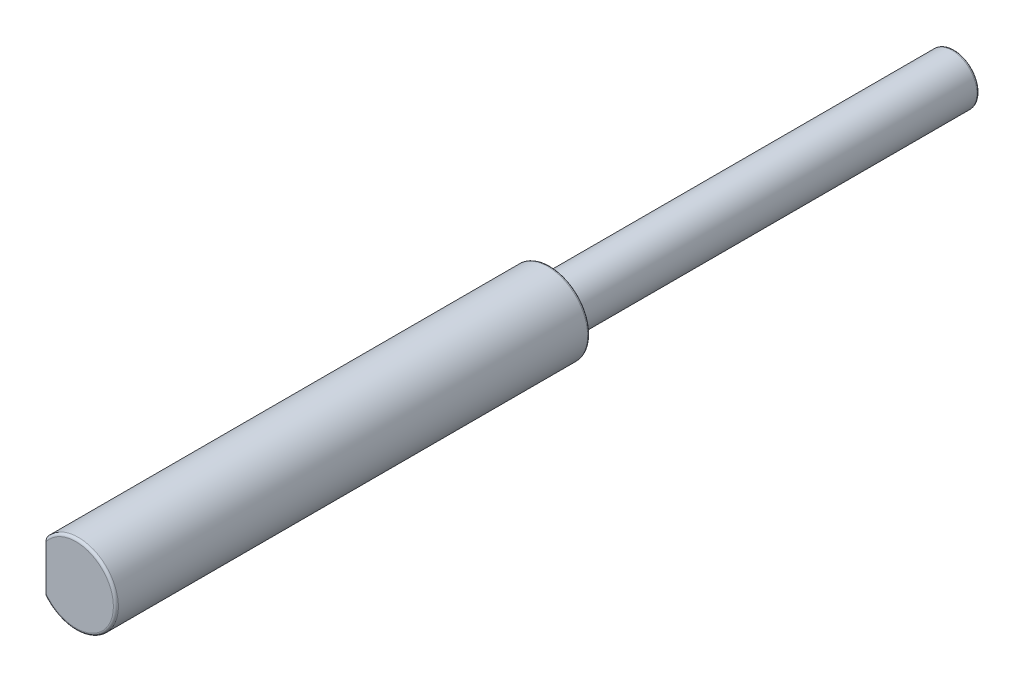
ISO-10303-21;
HEADER;
FILE_DESCRIPTION(('STEP AP214'),'2;1');
FILE_NAME('part.step','',(''),(''),'','','');
FILE_SCHEMA(('AUTOMOTIVE_DESIGN { 1 0 10303 214 1 1 1 1 }'));
ENDSEC;
DATA;
#1=APPLICATION_CONTEXT('core data for automotive mechanical design processes');
#2=APPLICATION_PROTOCOL_DEFINITION('international standard','automotive_design',2000,#1);
#3=PRODUCT_CONTEXT('',#1,'mechanical');
#4=PRODUCT('Part','Part','',(#3));
#5=PRODUCT_RELATED_PRODUCT_CATEGORY('part','',(#4));
#6=PRODUCT_DEFINITION_FORMATION('','',#4);
#7=PRODUCT_DEFINITION_CONTEXT('part definition',#1,'design');
#8=PRODUCT_DEFINITION('design','',#6,#7);
#9=PRODUCT_DEFINITION_SHAPE('','',#8);
#10=(LENGTH_UNIT() NAMED_UNIT(*) SI_UNIT(.MILLI.,.METRE.));
#11=(NAMED_UNIT(*) PLANE_ANGLE_UNIT() SI_UNIT($,.RADIAN.));
#12=(NAMED_UNIT(*) SI_UNIT($,.STERADIAN.) SOLID_ANGLE_UNIT());
#13=UNCERTAINTY_MEASURE_WITH_UNIT(LENGTH_MEASURE(1.E-05),#10,'distance_accuracy_value','');
#14=(GEOMETRIC_REPRESENTATION_CONTEXT(3) GLOBAL_UNCERTAINTY_ASSIGNED_CONTEXT((#13)) GLOBAL_UNIT_ASSIGNED_CONTEXT((#10,
#11,#12)) REPRESENTATION_CONTEXT('',''));
#15=CARTESIAN_POINT('',(0.,0.,0.));
#16=DIRECTION('',(0.,0.,1.));
#17=DIRECTION('',(1.,0.,0.));
#18=AXIS2_PLACEMENT_3D('',#15,#16,#17);
#19=CARTESIAN_POINT('',(0.,0.,88.));
#20=DIRECTION('',(0.,0.,-1.));
#21=DIRECTION('',(-1.,0.,0.));
#22=AXIS2_PLACEMENT_3D('',#19,#20,#21);
#23=CYLINDRICAL_SURFACE('',#22,4.);
#24=CARTESIAN_POINT('',(0.,0.,40.75));
#25=DIRECTION('',(0.,0.,1.));
#26=DIRECTION('',(1.,0.,0.));
#27=AXIS2_PLACEMENT_3D('',#24,#25,#26);
#28=CIRCLE('',#27,4.);
#29=CARTESIAN_POINT('',(4.,0.,40.75));
#30=VERTEX_POINT('',#29);
#31=EDGE_CURVE('E67',#30,#30,#28,.T.);
#32=ORIENTED_EDGE('',*,*,#31,.T.);
#33=EDGE_LOOP('',(#32));
#34=FACE_BOUND('',#33,.T.);
#35=DIRECTION('',(0.,0.,-1.));
#36=VECTOR('',#35,1.);
#37=CARTESIAN_POINT('',(-3.,2.6457513110646,88.));
#38=LINE('',#37,#36);
#39=CARTESIAN_POINT('',(-3.,2.64575131106459,87.75));
#40=VERTEX_POINT('',#39);
#41=CARTESIAN_POINT('',(-3.,2.64575131106459,74.));
#42=VERTEX_POINT('',#41);
#43=EDGE_CURVE('E63',#40,#42,#38,.T.);
#44=ORIENTED_EDGE('',*,*,#43,.F.);
#45=CARTESIAN_POINT('',(0.,0.,87.75));
#46=DIRECTION('',(0.,0.,1.));
#47=DIRECTION('',(1.,0.,0.));
#48=AXIS2_PLACEMENT_3D('',#45,#46,#47);
#49=CIRCLE('',#48,4.);
#50=CARTESIAN_POINT('',(-3.,-2.6457513110822,87.7500000000068));
#51=VERTEX_POINT('',#50);
#52=EDGE_CURVE('E71',#40,#51,#49,.F.);
#53=ORIENTED_EDGE('',*,*,#52,.T.);
#54=DIRECTION('',(0.,0.,-1.));
#55=VECTOR('',#54,1.);
#56=CARTESIAN_POINT('',(-3.,-2.6457513110646,88.));
#57=LINE('',#56,#55);
#58=CARTESIAN_POINT('',(-3.,-2.64575131106459,74.));
#59=VERTEX_POINT('',#58);
#60=EDGE_CURVE('E43',#59,#51,#57,.F.);
#61=ORIENTED_EDGE('',*,*,#60,.F.);
#62=CARTESIAN_POINT('',(-3.,2.64575131106459,74.));
#63=CARTESIAN_POINT('',(-2.99999721865765,2.64575264763035,73.9791771017932));
#64=CARTESIAN_POINT('',(-3.00065104414322,2.64501325874664,73.958366710262));
#65=CARTESIAN_POINT('',(-3.00323971390563,2.64207438655803,73.9169420901106));
#66=CARTESIAN_POINT('',(-3.00517377049945,2.6398758010454,73.8963277487733));
#67=CARTESIAN_POINT('',(-3.01280599735035,2.63117123632498,73.8353426194659));
#68=CARTESIAN_POINT('',(-3.02033543065855,2.62255555932588,73.7954723155136));
#69=CARTESIAN_POINT('',(-3.03963373462192,2.6001615243326,73.7184409175593));
#70=CARTESIAN_POINT('',(-3.05139419352771,2.5863934077931,73.6812746227141));
#71=CARTESIAN_POINT('',(-3.0783011290155,2.55431036258328,73.6102337240712));
#72=CARTESIAN_POINT('',(-3.09345363670256,2.53598732872243,73.5763651394893));
#73=CARTESIAN_POINT('',(-3.13187000105026,2.48849477917767,73.5013130031303));
#74=CARTESIAN_POINT('',(-3.156129633108,2.45776344734113,73.4616309088326));
#75=CARTESIAN_POINT('',(-3.20710305301898,2.39087242504346,73.3890245884467));
#76=CARTESIAN_POINT('',(-3.23382106534995,2.35470332008579,73.356112321799));
#77=CARTESIAN_POINT('',(-3.30122670008969,2.25979946283153,73.2821622461198));
#78=CARTESIAN_POINT('',(-3.34245199057519,2.19857897158432,73.2448310839982));
#79=CARTESIAN_POINT('',(-3.42361579489904,2.0699485141696,73.1811894601628));
#80=CARTESIAN_POINT('',(-3.46355153849736,2.00252628388307,73.1549014336163));
#81=CARTESIAN_POINT('',(-3.53484646453599,1.87336733874482,73.1139613798604));
#82=CARTESIAN_POINT('',(-3.56661475029614,1.81219964521164,73.0981819621234));
#83=CARTESIAN_POINT('',(-3.62731627895132,1.68742267036974,73.0714484532797));
#84=CARTESIAN_POINT('',(-3.65624747297848,1.62381167004316,73.0604978297251));
#85=CARTESIAN_POINT('',(-3.7109476554679,1.49459112155725,73.0422520561387));
#86=CARTESIAN_POINT('',(-3.73670982717343,1.42897763139668,73.0349646856023));
#87=CARTESIAN_POINT('',(-3.78479955844082,1.29625567319237,73.0231170022648));
#88=CARTESIAN_POINT('',(-3.8071260739466,1.22914675777103,73.0185575172255));
#89=CARTESIAN_POINT('',(-3.85943462888166,1.0567525442011,73.0093994357966));
#90=CARTESIAN_POINT('',(-3.88693700693209,0.950636920450571,73.0061398286207));
#91=CARTESIAN_POINT('',(-3.93315046452537,0.736441011684069,73.0019687385972));
#92=CARTESIAN_POINT('',(-3.95185752401383,0.628359851681853,73.0010583286396));
#93=CARTESIAN_POINT('',(-3.98034408732636,0.410956076560178,73.0000911568005));
#94=CARTESIAN_POINT('',(-3.99011822231769,0.301632754785655,73.000034907967));
#95=CARTESIAN_POINT('',(-4.00065035065044,0.0825776217681943,72.9999863969259));
#96=CARTESIAN_POINT('',(-4.00141028367213,-0.0271540965120479,72.9999941209518));
#97=CARTESIAN_POINT('',(-3.99386984659795,-0.247613686630557,73.0000114460675));
#98=CARTESIAN_POINT('',(-3.98546160868539,-0.358337883798051,73.0000210683898));
#99=CARTESIAN_POINT('',(-3.95946612595734,-0.578744445657669,73.0007373139181));
#100=CARTESIAN_POINT('',(-3.94187557043505,-0.688426420041016,73.0014441886021));
#101=CARTESIAN_POINT('',(-3.89770926519421,-0.905596700125143,73.0049994468546));
#102=CARTESIAN_POINT('',(-3.87116055288903,-1.01309058676677,73.007841417588));
#103=CARTESIAN_POINT('',(-3.80931776560386,-1.22526882041106,73.0178470845217));
#104=CARTESIAN_POINT('',(-3.77403167407755,-1.32995563602691,73.0250068440294));
#105=CARTESIAN_POINT('',(-3.70032697928781,-1.52208994372307,73.0452962961267));
#106=CARTESIAN_POINT('',(-3.66290834551977,-1.61001224680149,73.0575311845331));
#107=CARTESIAN_POINT('',(-3.58239930613603,-1.78196607247132,73.0903242497436));
#108=CARTESIAN_POINT('',(-3.53929901937067,-1.86599046376545,73.1108970596661));
#109=CARTESIAN_POINT('',(-3.47125539651786,-1.98812044184683,73.1508070404801));
#110=CARTESIAN_POINT('',(-3.4478025356239,-2.0284929432131,73.1657795253937));
#111=CARTESIAN_POINT('',(-3.40018915115657,-2.107327393042,73.1993269465626));
#112=CARTESIAN_POINT('',(-3.37602837200696,-2.14578863763951,73.2179031978185));
#113=CARTESIAN_POINT('',(-3.32761725160756,-2.2201173848571,73.2591176954024));
#114=CARTESIAN_POINT('',(-3.30336791042226,-2.2559965443526,73.281735838605));
#115=CARTESIAN_POINT('',(-3.25538285493451,-2.32470082681422,73.3316132867519));
#116=CARTESIAN_POINT('',(-3.23164649398324,-2.35752999049743,73.358866311685));
#117=CARTESIAN_POINT('',(-3.18613404355683,-2.41867077723185,73.4177848469809));
#118=CARTESIAN_POINT('',(-3.16432516159464,-2.44706985172822,73.449332721797));
#119=CARTESIAN_POINT('',(-3.12320743938391,-2.49933629808056,73.5174899411637));
#120=CARTESIAN_POINT('',(-3.10389861565918,-2.52320363998513,73.5540993191642));
#121=CARTESIAN_POINT('',(-3.06895780850736,-2.5655922609406,73.6325455676798));
#122=CARTESIAN_POINT('',(-3.05336811966535,-2.5840525425415,73.6744349849913));
#123=CARTESIAN_POINT('',(-3.02763772145431,-2.61415560244311,73.7621278057367));
#124=CARTESIAN_POINT('',(-3.01748317461369,-2.62581570036592,73.8079209223346));
#125=CARTESIAN_POINT('',(-3.00710313108807,-2.63768026327875,73.8785921473562));
#126=CARTESIAN_POINT('',(-3.00445057098784,-2.64069841459213,73.9026840851055));
#127=CARTESIAN_POINT('',(-3.00089570698436,-2.64473591728022,73.9511771744564));
#128=CARTESIAN_POINT('',(-2.99999449017435,-2.64575402719413,73.9755785086553));
#129=CARTESIAN_POINT('',(-3.,-2.64575131106459,74.));
#130=B_SPLINE_CURVE_WITH_KNOTS('',3,(#62,#63,#64,#65,#66,#67,#68,#69,#70,#71,#72,#73,#74,#75,
#76,#77,#78,#79,#80,#81,#82,#83,#84,#85,#86,#87,#88,#89,#90,#91,#92,#93,#94,#95,#96,#97,#98,#99,
#100,#101,#102,#103,#104,#105,#106,#107,#108,#109,#110,#111,#112,#113,#114,#115,#116,#117,#118,
#119,#120,#121,#122,#123,#124,#125,#126,#127,#128,#129),.UNSPECIFIED.,.F.,.F.,(4,2,2,2,2,2,2,2,
2,2,2,2,2,2,2,2,2,2,2,2,2,2,2,2,2,2,2,2,2,2,2,2,2,4),(0.,0.0624213818930164,0.12480439366905,
0.248514890479601,0.371980784030101,0.495667970086297,0.661980300924781,0.828583959147491,
1.07532693487923,1.32256879582872,1.53439454234983,1.74637215398901,1.95879805156582,
2.17128837596731,2.49984523338533,2.82855211782832,3.15745643078082,3.48628996866264,
3.81903454636186,4.15189917887301,4.48376801806338,4.81533473627188,5.10389463563044,
5.39296316813102,5.53992129300826,5.68693314355221,5.83323318261977,5.97933654982481,
6.12203495676126,6.26473430679555,6.40898639615411,6.5528694620405,6.62601280639634,
6.69920153778217),.UNSPECIFIED.);
#131=EDGE_CURVE('E11',#42,#59,#130,.T.);
#132=ORIENTED_EDGE('',*,*,#131,.F.);
#133=EDGE_LOOP('',(#44,#53,#61,#132));
#134=FACE_BOUND('',#133,.T.);
#135=ADVANCED_FACE('F17',(#34,#134),#23,.T.);
#136=CARTESIAN_POINT('',(0.,0.,88.));
#137=DIRECTION('',(0.,0.,1.));
#138=DIRECTION('',(1.,0.,0.));
#139=AXIS2_PLACEMENT_3D('',#136,#137,#138);
#140=PLANE('',#139);
#141=CARTESIAN_POINT('',(0.,0.,88.));
#142=DIRECTION('',(0.,0.,1.));
#143=DIRECTION('',(1.,0.,0.));
#144=AXIS2_PLACEMENT_3D('',#141,#142,#143);
#145=CIRCLE('',#144,3.75);
#146=CARTESIAN_POINT('',(-3.,-2.25,88.));
#147=VERTEX_POINT('',#146);
#148=CARTESIAN_POINT('',(-3.,2.25,88.));
#149=VERTEX_POINT('',#148);
#150=EDGE_CURVE('E62',#147,#149,#145,.T.);
#151=ORIENTED_EDGE('',*,*,#150,.T.);
#152=DIRECTION('',(0.,-1.,0.));
#153=VECTOR('',#152,1.);
#154=CARTESIAN_POINT('',(-3.,3.,88.));
#155=LINE('',#154,#153);
#156=EDGE_CURVE('E37',#149,#147,#155,.T.);
#157=ORIENTED_EDGE('',*,*,#156,.T.);
#158=EDGE_LOOP('',(#151,#157));
#159=FACE_BOUND('',#158,.T.);
#160=ADVANCED_FACE('F61',(#159),#140,.T.);
#161=CARTESIAN_POINT('',(0.,0.,87.75));
#162=DIRECTION('',(0.,0.,1.));
#163=DIRECTION('',(1.,0.,0.));
#164=AXIS2_PLACEMENT_3D('',#161,#162,#163);
#165=TOROIDAL_SURFACE('',#164,3.75,0.25);
#166=ORIENTED_EDGE('',*,*,#150,.F.);
#167=CARTESIAN_POINT('',(-3.,-2.64403443439112,87.773799386496));
#168=CARTESIAN_POINT('',(-3.,-2.64548008209283,87.7637991792488));
#169=CARTESIAN_POINT('',(-3.,-2.64601894439263,87.7536628933207));
#170=CARTESIAN_POINT('',(-3.,-2.64523302235052,87.7334621879101));
#171=CARTESIAN_POINT('',(-3.,-2.64390762437684,87.7233977931873));
#172=CARTESIAN_POINT('',(-3.,-2.63951461745774,87.7037061693858));
#173=CARTESIAN_POINT('',(-3.,-2.63645413590111,87.6940773247937));
#174=CARTESIAN_POINT('',(-3.,-2.62881935178045,87.6754444862192));
#175=CARTESIAN_POINT('',(-3.,-2.62424407722402,87.6664408979423));
#176=CARTESIAN_POINT('',(-3.,-2.61217205629197,87.6464275375019));
#177=CARTESIAN_POINT('',(-3.,-2.60420895259583,87.6356999728884));
#178=CARTESIAN_POINT('',(-3.,-2.58666453164139,87.615667009744));
#179=CARTESIAN_POINT('',(-3.,-2.57708021676427,87.6063643076297));
#180=CARTESIAN_POINT('',(-3.,-2.55218057990881,87.5852791740603));
#181=CARTESIAN_POINT('',(-3.,-2.53622368259635,87.5742576326543));
#182=CARTESIAN_POINT('',(-3.,-2.50280775035837,87.5548276994062));
#183=CARTESIAN_POINT('',(-3.,-2.48534597811795,87.546424203473));
#184=CARTESIAN_POINT('',(-3.,-2.44000991696766,87.528070288353));
#185=CARTESIAN_POINT('',(-3.,-2.41151600262545,87.5196550801432));
#186=CARTESIAN_POINT('',(-3.,-2.35357638959478,87.5073132836025));
#187=CARTESIAN_POINT('',(-3.,-2.32412862183646,87.5033972331905));
#188=CARTESIAN_POINT('',(-3.,-2.25506625849842,87.4988535697874));
#189=CARTESIAN_POINT('',(-3.,-2.21535002713903,87.4997667379759));
#190=CARTESIAN_POINT('',(-3.,-2.13660249477216,87.5080171263185));
#191=CARTESIAN_POINT('',(-3.,-2.0975709102282,87.515351619886));
#192=CARTESIAN_POINT('',(-3.,-2.03569507596191,87.5327337685853));
#193=CARTESIAN_POINT('',(-3.,-2.01226663775107,87.5407343046806));
#194=CARTESIAN_POINT('',(-3.,-1.96664210255545,87.559697889111));
#195=CARTESIAN_POINT('',(-3.,-1.94444342864987,87.5706544364845));
#196=CARTESIAN_POINT('',(-3.,-1.91066325463895,87.5910607654904));
#197=CARTESIAN_POINT('',(-3.,-1.89838758004632,87.5993592839936));
#198=CARTESIAN_POINT('',(-3.,-1.87499756335768,87.6174801089334));
#199=CARTESIAN_POINT('',(-3.,-1.86388192061472,87.627300677428));
#200=CARTESIAN_POINT('',(-3.,-1.84655907541748,87.6454746157797));
#201=CARTESIAN_POINT('',(-3.,-1.83988267837086,87.6533769811538));
#202=CARTESIAN_POINT('',(-3.,-1.82778772407118,87.6700978890006));
#203=CARTESIAN_POINT('',(-3.,-1.82236695991516,87.6789147839788));
#204=CARTESIAN_POINT('',(-3.,-1.81431926074574,87.6952526881523));
#205=CARTESIAN_POINT('',(-3.,-1.81133557553406,87.7025961759204));
#206=CARTESIAN_POINT('',(-3.,-1.80662039162596,87.7176759504796));
#207=CARTESIAN_POINT('',(-3.,-1.80488751132736,87.7254117937426));
#208=CARTESIAN_POINT('',(-3.,-1.80284057935687,87.7411184716819));
#209=CARTESIAN_POINT('',(-3.,-1.80253463142567,87.7490903903957));
#210=CARTESIAN_POINT('',(-3.,-1.80339965150945,87.7649540928953));
#211=CARTESIAN_POINT('',(-3.,-1.80457103480006,87.7728458535202));
#212=CARTESIAN_POINT('',(-3.,-1.80811705076881,87.7876974712593));
#213=CARTESIAN_POINT('',(-3.,-1.81039109650221,87.7946820876467));
#214=CARTESIAN_POINT('',(-3.,-1.8159094822313,87.8082517674828));
#215=CARTESIAN_POINT('',(-3.,-1.81915419560708,87.8148366760039));
#216=CARTESIAN_POINT('',(-3.,-1.82870277876567,87.8315275116382));
#217=CARTESIAN_POINT('',(-3.,-1.83565153696067,87.8412636510756));
#218=CARTESIAN_POINT('',(-3.,-1.85096656633348,87.8595505233537));
#219=CARTESIAN_POINT('',(-3.,-1.85933725226783,87.868097408728));
#220=CARTESIAN_POINT('',(-3.,-1.88325213702847,87.8897428591339));
#221=CARTESIAN_POINT('',(-3.,-1.89970832425127,87.9018268624866));
#222=CARTESIAN_POINT('',(-3.,-1.93417412158842,87.9234837178141));
#223=CARTESIAN_POINT('',(-3.,-1.95218737002524,87.9330504648916));
#224=CARTESIAN_POINT('',(-3.,-2.00235055966852,87.9561539181798));
#225=CARTESIAN_POINT('',(-3.,-2.03543392326732,87.9676672670818));
#226=CARTESIAN_POINT('',(-3.,-2.10296154344466,87.9855282687586));
#227=CARTESIAN_POINT('',(-3.,-2.13740838531296,87.9918655617449));
#228=CARTESIAN_POINT('',(-3.,-2.20846582258767,87.9997012414701));
#229=CARTESIAN_POINT('',(-3.,-2.24510294776019,88.0009630196141));
#230=CARTESIAN_POINT('',(-3.,-2.31807622984912,87.9975850196351));
#231=CARTESIAN_POINT('',(-3.,-2.35441292266211,87.9929606330341));
#232=CARTESIAN_POINT('',(-3.,-2.41115313243636,87.9800698367586));
#233=CARTESIAN_POINT('',(-3.,-2.43206597181788,87.9740279019501));
#234=CARTESIAN_POINT('',(-3.,-2.47288418766015,87.9591323519445));
#235=CARTESIAN_POINT('',(-3.,-2.49279059213842,87.9502816758551));
#236=CARTESIAN_POINT('',(-3.,-2.52604176181616,87.9319844157199));
#237=CARTESIAN_POINT('',(-3.,-2.53977599934465,87.92324994376));
#238=CARTESIAN_POINT('',(-3.,-2.56575479232988,87.9037746825587));
#239=CARTESIAN_POINT('',(-3.,-2.57800163792792,87.8930370439518));
#240=CARTESIAN_POINT('',(-3.,-2.59717379597999,87.8727286708829));
#241=CARTESIAN_POINT('',(-3.,-2.60463210860649,87.8636630644112));
#242=CARTESIAN_POINT('',(-3.,-2.61801586467654,87.8444631313872));
#243=CARTESIAN_POINT('',(-3.,-2.62394402680157,87.834330745972));
#244=CARTESIAN_POINT('',(-3.,-2.63260667329638,87.8158386275426));
#245=CARTESIAN_POINT('',(-3.,-2.63576972988001,87.8076794545269));
#246=CARTESIAN_POINT('',(-3.,-2.64085891973677,87.7909804843886));
#247=CARTESIAN_POINT('',(-3.,-2.64278522494664,87.7824407403508));
#248=CARTESIAN_POINT('',(-3.,-2.64403443439112,87.773799386496));
#249=B_SPLINE_CURVE_WITH_KNOTS('',3,(#167,#168,#169,#170,#171,#172,#173,#174,#175,#176,#177,
#178,#179,#180,#181,#182,#183,#184,#185,#186,#187,#188,#189,#190,#191,#192,#193,#194,#195,#196,
#197,#198,#199,#200,#201,#202,#203,#204,#205,#206,#207,#208,#209,#210,#211,#212,#213,#214,#215,
#216,#217,#218,#219,#220,#221,#222,#223,#224,#225,#226,#227,#228,#229,#230,#231,#232,#233,#234,
#235,#236,#237,#238,#239,#240,#241,#242,#243,#244,#245,#246,#247,#248),.UNSPECIFIED.,.T.,.F.,(4,
2,2,2,2,2,2,2,2,2,2,2,2,2,2,2,2,2,2,2,2,2,2,2,2,2,2,2,2,2,2,2,2,2,2,2,2,2,2,2,4),(0.,
0.0302770466454884,0.0605640614839078,0.0907275553200971,0.120910441702862,0.16076965733716,
0.200703394790191,0.258559590351517,0.316523340028359,0.405164831391328,0.494013518130147,
0.612621643950299,0.731179431473406,0.805303019231097,0.879264902249338,0.923632640498132,
0.967950086012278,0.998899326319217,1.02979375028496,1.0534809680885,1.07714198148439,
1.10093720664919,1.12473912210808,1.14669124237505,1.16865181769596,1.20432932962018,
1.24011970723737,1.30102484280681,1.36207635291656,1.46659757025694,1.57132747591428,
1.68088672288388,1.79016007494496,1.8553118222923,1.92039561746822,1.96907971280424,
2.01768787236174,2.05278620564989,2.08782174221728,2.11398830591141,2.14015123106634),.UNSPECIFIED.);
#250=EDGE_CURVE('E30',#147,#51,#249,.T.);
#251=ORIENTED_EDGE('',*,*,#250,.T.);
#252=ORIENTED_EDGE('',*,*,#52,.F.);
#253=CARTESIAN_POINT('',(-3.,1.80743517594842,87.7845742979698));
#254=CARTESIAN_POINT('',(-3.,1.8052328147078,87.7764304105719));
#255=CARTESIAN_POINT('',(-3.,1.8037698321215,87.7680771640308));
#256=CARTESIAN_POINT('',(-3.,1.80250656920737,87.7512459962469));
#257=CARTESIAN_POINT('',(-3.,1.80270585534769,87.7427681080874));
#258=CARTESIAN_POINT('',(-3.,1.80473549982463,87.7260424827373));
#259=CARTESIAN_POINT('',(-3.,1.80656073890941,87.7177941069251));
#260=CARTESIAN_POINT('',(-3.,1.81162567003213,87.7017447503992));
#261=CARTESIAN_POINT('',(-3.,1.81486735779015,87.6939444185712));
#262=CARTESIAN_POINT('',(-3.,1.82368735748316,87.6765508009437));
#263=CARTESIAN_POINT('',(-3.,1.82968038884578,87.6671703776163));
#264=CARTESIAN_POINT('',(-3.,1.84304864485749,87.6494615679348));
#265=CARTESIAN_POINT('',(-3.,1.85042667649138,87.6411353766129));
#266=CARTESIAN_POINT('',(-3.,1.87139525768373,87.6202119162724));
#267=CARTESIAN_POINT('',(-3.,1.88584209112498,87.6084795891017));
#268=CARTESIAN_POINT('',(-3.,1.91627507351345,87.5872413141373));
#269=CARTESIAN_POINT('',(-3.,1.93226534464623,87.5777415749797));
#270=CARTESIAN_POINT('',(-3.,1.97759936721129,87.5541551976278));
#271=CARTESIAN_POINT('',(-3.,2.0079424371903,87.5419912941246));
#272=CARTESIAN_POINT('',(-3.,2.07007871075844,87.52233239442));
#273=CARTESIAN_POINT('',(-3.,2.10187434053954,87.5148455408175));
#274=CARTESIAN_POINT('',(-3.,2.16814276511171,87.5039172355315));
#275=CARTESIAN_POINT('',(-3.,2.20266089792902,87.5007489886682));
#276=CARTESIAN_POINT('',(-3.,2.27177317278933,87.4994855109975));
#277=CARTESIAN_POINT('',(-3.,2.30636715397177,87.5013835776994));
#278=CARTESIAN_POINT('',(-3.,2.36553623116396,87.509598495937));
#279=CARTESIAN_POINT('',(-3.,2.39029624868739,87.514584990618));
#280=CARTESIAN_POINT('',(-3.,2.43887078439411,87.528036956941));
#281=CARTESIAN_POINT('',(-3.,2.46268651138729,87.5364978121978));
#282=CARTESIAN_POINT('',(-3.,2.50141883617806,87.5542595679249));
#283=CARTESIAN_POINT('',(-3.,2.51681923693485,87.5625013358062));
#284=CARTESIAN_POINT('',(-3.,2.54623832184498,87.5811812565674));
#285=CARTESIAN_POINT('',(-3.,2.56025911427145,87.5916159792333));
#286=CARTESIAN_POINT('',(-3.,2.5825777295593,87.6116561156901));
#287=CARTESIAN_POINT('',(-3.,2.59138525372785,87.6206911840553));
#288=CARTESIAN_POINT('',(-3.,2.6074798164773,87.6400336128527));
#289=CARTESIAN_POINT('',(-3.,2.61476896887076,87.6503391722894));
#290=CARTESIAN_POINT('',(-3.,2.62614352509558,87.6700413596759));
#291=CARTESIAN_POINT('',(-3.,2.63057471146804,87.6792371929841));
#292=CARTESIAN_POINT('',(-3.,2.63785229687974,87.6982395898317));
#293=CARTESIAN_POINT('',(-3.,2.64069978907657,87.7080457268926));
#294=CARTESIAN_POINT('',(-3.,2.64460489805234,87.7280684051264));
#295=CARTESIAN_POINT('',(-3.,2.64565289315023,87.7382868552978));
#296=CARTESIAN_POINT('',(-3.,2.64583636952696,87.7587405055993));
#297=CARTESIAN_POINT('',(-3.,2.64497213274498,87.7689757030377));
#298=CARTESIAN_POINT('',(-3.,2.64156090521181,87.7882615668717));
#299=CARTESIAN_POINT('',(-3.,2.63916236386081,87.7973392186638));
#300=CARTESIAN_POINT('',(-3.,2.63298994606412,87.8150100846804));
#301=CARTESIAN_POINT('',(-3.,2.62921558553374,87.8236031271639));
#302=CARTESIAN_POINT('',(-3.,2.61898170641749,87.8430407759271));
#303=CARTESIAN_POINT('',(-3.,2.61204494062025,87.853633946765));
#304=CARTESIAN_POINT('',(-3.,2.5965484271607,87.8735559974321));
#305=CARTESIAN_POINT('',(-3.,2.58798553211629,87.8828823642953));
#306=CARTESIAN_POINT('',(-3.,2.56579427118389,87.9039364210792));
#307=CARTESIAN_POINT('',(-3.,2.55155347456095,87.9150158757609));
#308=CARTESIAN_POINT('',(-3.,2.52153089849011,87.9348143576657));
#309=CARTESIAN_POINT('',(-3.,2.50574631182966,87.943528971895));
#310=CARTESIAN_POINT('',(-3.,2.46460548284584,87.9629082726534));
#311=CARTESIAN_POINT('',(-3.,2.43859334436246,87.9721757114717));
#312=CARTESIAN_POINT('',(-3.,2.38546867320279,87.9866022245613));
#313=CARTESIAN_POINT('',(-3.,2.35835398260679,87.991752790042));
#314=CARTESIAN_POINT('',(-3.,2.29265432131112,87.9998412480159));
#315=CARTESIAN_POINT('',(-3.,2.2538558413905,88.0010476630909));
#316=CARTESIAN_POINT('',(-3.,2.17654746849227,87.9972229294555));
#317=CARTESIAN_POINT('',(-3.,2.13803797332169,87.9921843654119));
#318=CARTESIAN_POINT('',(-3.,2.07139433844723,87.9778232009146));
#319=CARTESIAN_POINT('',(-3.,2.04297409586418,87.9698071999043));
#320=CARTESIAN_POINT('',(-3.,1.98760592668678,87.949806739353));
#321=CARTESIAN_POINT('',(-3.,1.96065265967883,87.937837977583));
#322=CARTESIAN_POINT('',(-3.,1.92289426469592,87.9165797599399));
#323=CARTESIAN_POINT('',(-3.,1.91102663741326,87.9091713822135));
#324=CARTESIAN_POINT('',(-3.,1.88817087681651,87.8930596324687));
#325=CARTESIAN_POINT('',(-3.,1.87718327040842,87.884355493407));
#326=CARTESIAN_POINT('',(-3.,1.8580529516504,87.8668317673653));
#327=CARTESIAN_POINT('',(-3.,1.84972881940414,87.8582125033525));
#328=CARTESIAN_POINT('',(-3.,1.83454218453355,87.8397769118146));
#329=CARTESIAN_POINT('',(-3.,1.82767446778696,87.829965059473));
#330=CARTESIAN_POINT('',(-3.,1.81878761910451,87.8140406457383));
#331=CARTESIAN_POINT('',(-3.,1.81600548574606,87.8083525674496));
#332=CARTESIAN_POINT('',(-3.,1.81115510332698,87.7966737696716));
#333=CARTESIAN_POINT('',(-3.,1.8090871406089,87.7906829298927));
#334=CARTESIAN_POINT('',(-3.,1.80743517594842,87.7845742979698));
#335=B_SPLINE_CURVE_WITH_KNOTS('',3,(#253,#254,#255,#256,#257,#258,#259,#260,#261,#262,#263,
#264,#265,#266,#267,#268,#269,#270,#271,#272,#273,#274,#275,#276,#277,#278,#279,#280,#281,#282,
#283,#284,#285,#286,#287,#288,#289,#290,#291,#292,#293,#294,#295,#296,#297,#298,#299,#300,#301,
#302,#303,#304,#305,#306,#307,#308,#309,#310,#311,#312,#313,#314,#315,#316,#317,#318,#319,#320,
#321,#322,#323,#324,#325,#326,#327,#328,#329,#330,#331,#332,#333,#334),.UNSPECIFIED.,.T.,.F.,(4,
2,2,2,2,2,2,2,2,2,2,2,2,2,2,2,2,2,2,2,2,2,2,2,2,2,2,2,2,2,2,2,2,2,2,2,2,2,2,2,4),(0.,
0.0252816712353773,0.0505567490320665,0.0757525293524896,0.10098392458117,0.134192669770954,
0.167469460460043,0.22298813269125,0.278659417460855,0.376195177090431,0.47390027365247,
0.577537325528572,0.681037338514643,0.756612961301882,0.832088489971712,0.88434540502035,
0.93652118035624,0.974250398590123,1.01192673549701,1.0424262951007,1.07290477592797,
1.1035457196321,1.134182145941,1.16222835654042,1.19028444479463,1.22806122730015,
1.26591188625994,1.31974048246746,1.37366884725145,1.45605197937111,1.53860494456708,
1.65446918104408,1.77047112744701,1.85883693860917,1.9468559560541,1.98876461313394,
2.0306981779909,2.06654219257559,2.10225563051536,2.1212115163839,2.14017499370469),.UNSPECIFIED.);
#336=EDGE_CURVE('E58',#40,#149,#335,.T.);
#337=ORIENTED_EDGE('',*,*,#336,.T.);
#338=EDGE_LOOP('',(#166,#251,#252,#337));
#339=FACE_BOUND('',#338,.T.);
#340=ADVANCED_FACE('F66',(#339),#165,.T.);
#341=CARTESIAN_POINT('',(0.,0.,40.5));
#342=DIRECTION('',(0.,0.,-1.));
#343=DIRECTION('',(-1.,0.,0.));
#344=AXIS2_PLACEMENT_3D('',#341,#342,#343);
#345=CYLINDRICAL_SURFACE('',#344,2.5);
#346=CARTESIAN_POINT('',(0.,0.,0.25));
#347=DIRECTION('',(0.,0.,1.));
#348=DIRECTION('',(1.,0.,0.));
#349=AXIS2_PLACEMENT_3D('',#346,#347,#348);
#350=CIRCLE('',#349,2.5);
#351=CARTESIAN_POINT('',(2.5,0.,0.25));
#352=VERTEX_POINT('',#351);
#353=EDGE_CURVE('E81',#352,#352,#350,.T.);
#354=ORIENTED_EDGE('',*,*,#353,.T.);
#355=EDGE_LOOP('',(#354));
#356=FACE_BOUND('',#355,.T.);
#357=CARTESIAN_POINT('',(0.,0.,40.5));
#358=DIRECTION('',(0.,0.,1.));
#359=DIRECTION('',(1.,0.,0.));
#360=AXIS2_PLACEMENT_3D('',#357,#358,#359);
#361=CIRCLE('',#360,2.5);
#362=CARTESIAN_POINT('',(2.5,0.,40.5));
#363=VERTEX_POINT('',#362);
#364=EDGE_CURVE('E68',#363,#363,#361,.T.);
#365=ORIENTED_EDGE('',*,*,#364,.F.);
#366=EDGE_LOOP('',(#365));
#367=FACE_BOUND('',#366,.T.);
#368=ADVANCED_FACE('F113',(#356,#367),#345,.T.);
#369=CARTESIAN_POINT('',(0.,0.,0.));
#370=DIRECTION('',(0.,0.,1.));
#371=DIRECTION('',(1.,0.,0.));
#372=AXIS2_PLACEMENT_3D('',#369,#370,#371);
#373=PLANE('',#372);
#374=CARTESIAN_POINT('',(0.,0.,0.));
#375=DIRECTION('',(0.,0.,1.));
#376=DIRECTION('',(1.,0.,0.));
#377=AXIS2_PLACEMENT_3D('',#374,#375,#376);
#378=CIRCLE('',#377,2.25);
#379=CARTESIAN_POINT('',(2.25,0.,0.));
#380=VERTEX_POINT('',#379);
#381=EDGE_CURVE('E84',#380,#380,#378,.F.);
#382=ORIENTED_EDGE('',*,*,#381,.T.);
#383=EDGE_LOOP('',(#382));
#384=FACE_BOUND('',#383,.T.);
#385=ADVANCED_FACE('F106',(#384),#373,.F.);
#386=CARTESIAN_POINT('',(0.,0.,40.5));
#387=DIRECTION('',(0.,0.,1.));
#388=DIRECTION('',(1.,0.,0.));
#389=AXIS2_PLACEMENT_3D('',#386,#387,#388);
#390=PLANE('',#389);
#391=CARTESIAN_POINT('',(0.,0.,40.5));
#392=DIRECTION('',(0.,0.,1.));
#393=DIRECTION('',(1.,0.,0.));
#394=AXIS2_PLACEMENT_3D('',#391,#392,#393);
#395=CIRCLE('',#394,3.75);
#396=CARTESIAN_POINT('',(3.75,0.,40.5));
#397=VERTEX_POINT('',#396);
#398=EDGE_CURVE('E78',#397,#397,#395,.F.);
#399=ORIENTED_EDGE('',*,*,#398,.T.);
#400=EDGE_LOOP('',(#399));
#401=FACE_BOUND('',#400,.T.);
#402=ORIENTED_EDGE('',*,*,#364,.T.);
#403=EDGE_LOOP('',(#402));
#404=FACE_BOUND('',#403,.T.);
#405=ADVANCED_FACE('F103',(#401,#404),#390,.F.);
#406=CARTESIAN_POINT('',(0.,0.,40.75));
#407=DIRECTION('',(0.,0.,1.));
#408=DIRECTION('',(1.,0.,0.));
#409=AXIS2_PLACEMENT_3D('',#406,#407,#408);
#410=TOROIDAL_SURFACE('',#409,3.75,0.25);
#411=ORIENTED_EDGE('',*,*,#398,.F.);
#412=EDGE_LOOP('',(#411));
#413=FACE_BOUND('',#412,.T.);
#414=ORIENTED_EDGE('',*,*,#31,.F.);
#415=EDGE_LOOP('',(#414));
#416=FACE_BOUND('',#415,.T.);
#417=ADVANCED_FACE('F105',(#413,#416),#410,.T.);
#418=CARTESIAN_POINT('',(0.,0.,0.25));
#419=DIRECTION('',(0.,0.,1.));
#420=DIRECTION('',(1.,0.,0.));
#421=AXIS2_PLACEMENT_3D('',#418,#419,#420);
#422=TOROIDAL_SURFACE('',#421,2.25,0.25);
#423=ORIENTED_EDGE('',*,*,#381,.F.);
#424=EDGE_LOOP('',(#423));
#425=FACE_BOUND('',#424,.T.);
#426=ORIENTED_EDGE('',*,*,#353,.F.);
#427=EDGE_LOOP('',(#426));
#428=FACE_BOUND('',#427,.T.);
#429=ADVANCED_FACE('F19',(#425,#428),#422,.T.);
#430=CARTESIAN_POINT('',(-4.,3.,74.));
#431=DIRECTION('',(0.,-1.,0.));
#432=DIRECTION('',(0.,0.,-1.));
#433=AXIS2_PLACEMENT_3D('',#430,#431,#432);
#434=CYLINDRICAL_SURFACE('',#433,1.);
#435=DIRECTION('',(0.,-1.,0.));
#436=VECTOR('',#435,1.);
#437=CARTESIAN_POINT('',(-3.,3.,74.));
#438=LINE('',#437,#436);
#439=EDGE_CURVE('E64',#42,#59,#438,.T.);
#440=ORIENTED_EDGE('',*,*,#439,.F.);
#441=ORIENTED_EDGE('',*,*,#131,.T.);
#442=EDGE_LOOP('',(#440,#441));
#443=FACE_BOUND('',#442,.T.);
#444=ADVANCED_FACE('F98',(#443),#434,.F.);
#445=CARTESIAN_POINT('',(-3.,3.,74.));
#446=DIRECTION('',(-1.,0.,0.));
#447=DIRECTION('',(0.,0.,1.));
#448=AXIS2_PLACEMENT_3D('',#445,#446,#447);
#449=PLANE('',#448);
#450=ORIENTED_EDGE('',*,*,#60,.T.);
#451=ORIENTED_EDGE('',*,*,#250,.F.);
#452=ORIENTED_EDGE('',*,*,#156,.F.);
#453=ORIENTED_EDGE('',*,*,#336,.F.);
#454=ORIENTED_EDGE('',*,*,#43,.T.);
#455=ORIENTED_EDGE('',*,*,#439,.T.);
#456=EDGE_LOOP('',(#450,#451,#452,#453,#454,#455));
#457=FACE_BOUND('',#456,.T.);
#458=ADVANCED_FACE('F53',(#457),#449,.T.);
#459=CLOSED_SHELL('',(#135,#160,#340,#368,#385,#405,#417,#429,#444,#458));
#460=MANIFOLD_SOLID_BREP('B1',#459);
#461=ADVANCED_BREP_SHAPE_REPRESENTATION('',(#18,#460),#14);
#462=SHAPE_DEFINITION_REPRESENTATION(#9,#461);
ENDSEC;
END-ISO-10303-21;
